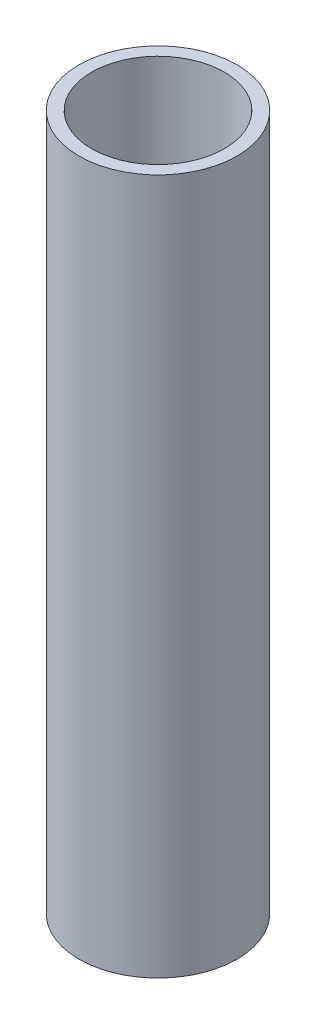
ISO-10303-21;
HEADER;
FILE_DESCRIPTION(('STEP AP214'),'2;1');
FILE_NAME('part.step','',(''),(''),'','','');
FILE_SCHEMA(('AUTOMOTIVE_DESIGN { 1 0 10303 214 1 1 1 1 }'));
ENDSEC;
DATA;
#1=APPLICATION_CONTEXT('core data for automotive mechanical design processes');
#2=APPLICATION_PROTOCOL_DEFINITION('international standard','automotive_design',2000,#1);
#3=PRODUCT_CONTEXT('',#1,'mechanical');
#4=PRODUCT('Part','Part','',(#3));
#5=PRODUCT_RELATED_PRODUCT_CATEGORY('part','',(#4));
#6=PRODUCT_DEFINITION_FORMATION('','',#4);
#7=PRODUCT_DEFINITION_CONTEXT('part definition',#1,'design');
#8=PRODUCT_DEFINITION('design','',#6,#7);
#9=PRODUCT_DEFINITION_SHAPE('','',#8);
#10=(LENGTH_UNIT() NAMED_UNIT(*) SI_UNIT(.MILLI.,.METRE.));
#11=(NAMED_UNIT(*) PLANE_ANGLE_UNIT() SI_UNIT($,.RADIAN.));
#12=(NAMED_UNIT(*) SI_UNIT($,.STERADIAN.) SOLID_ANGLE_UNIT());
#13=UNCERTAINTY_MEASURE_WITH_UNIT(LENGTH_MEASURE(1.E-05),#10,'distance_accuracy_value','');
#14=(GEOMETRIC_REPRESENTATION_CONTEXT(3) GLOBAL_UNCERTAINTY_ASSIGNED_CONTEXT((#13)) GLOBAL_UNIT_ASSIGNED_CONTEXT((#10,
#11,#12)) REPRESENTATION_CONTEXT('',''));
#15=CARTESIAN_POINT('',(0.,0.,0.));
#16=DIRECTION('',(0.,0.,1.));
#17=DIRECTION('',(1.,0.,0.));
#18=AXIS2_PLACEMENT_3D('',#15,#16,#17);
#19=CARTESIAN_POINT('',(0.,26.0212825230672,0.));
#20=DIRECTION('',(0.,1.,0.));
#21=DIRECTION('',(0.,0.,1.));
#22=AXIS2_PLACEMENT_3D('',#19,#20,#21);
#23=CYLINDRICAL_SURFACE('',#22,10.5);
#24=CARTESIAN_POINT('',(0.,86.,0.));
#25=DIRECTION('',(0.,1.,0.));
#26=DIRECTION('',(0.,0.,1.));
#27=AXIS2_PLACEMENT_3D('',#24,#25,#26);
#28=CIRCLE('',#27,10.5);
#29=CARTESIAN_POINT('',(0.,86.,10.5));
#30=VERTEX_POINT('',#29);
#31=EDGE_CURVE('E58',#30,#30,#28,.T.);
#32=ORIENTED_EDGE('',*,*,#31,.F.);
#33=EDGE_LOOP('',(#32));
#34=FACE_BOUND('',#33,.T.);
#35=CARTESIAN_POINT('',(0.,110.,0.));
#36=DIRECTION('',(0.,1.,0.));
#37=DIRECTION('',(0.,0.,1.));
#38=AXIS2_PLACEMENT_3D('',#35,#36,#37);
#39=CIRCLE('',#38,10.5);
#40=CARTESIAN_POINT('',(0.,110.,10.5));
#41=VERTEX_POINT('',#40);
#42=EDGE_CURVE('E10',#41,#41,#39,.T.);
#43=ORIENTED_EDGE('',*,*,#42,.T.);
#44=EDGE_LOOP('',(#43));
#45=FACE_BOUND('',#44,.T.);
#46=ADVANCED_FACE('F30',(#34,#45),#23,.F.);
#47=CARTESIAN_POINT('',(10.5,110.,0.));
#48=DIRECTION('',(0.,-1.,0.));
#49=DIRECTION('',(0.,0.,-1.));
#50=AXIS2_PLACEMENT_3D('',#47,#48,#49);
#51=PLANE('',#50);
#52=ORIENTED_EDGE('',*,*,#42,.F.);
#53=EDGE_LOOP('',(#52));
#54=FACE_BOUND('',#53,.T.);
#55=CARTESIAN_POINT('',(0.,110.,0.));
#56=DIRECTION('',(0.,1.,0.));
#57=DIRECTION('',(0.,0.,1.));
#58=AXIS2_PLACEMENT_3D('',#55,#56,#57);
#59=CIRCLE('',#58,12.5);
#60=CARTESIAN_POINT('',(0.,110.,12.5));
#61=VERTEX_POINT('',#60);
#62=EDGE_CURVE('E36',#61,#61,#59,.T.);
#63=ORIENTED_EDGE('',*,*,#62,.T.);
#64=EDGE_LOOP('',(#63));
#65=FACE_BOUND('',#64,.T.);
#66=ADVANCED_FACE('F65',(#54,#65),#51,.F.);
#67=CARTESIAN_POINT('',(0.,26.0212825230672,0.));
#68=DIRECTION('',(0.,1.,0.));
#69=DIRECTION('',(0.,0.,1.));
#70=AXIS2_PLACEMENT_3D('',#67,#68,#69);
#71=CYLINDRICAL_SURFACE('',#70,12.5);
#72=ORIENTED_EDGE('',*,*,#62,.F.);
#73=EDGE_LOOP('',(#72));
#74=FACE_BOUND('',#73,.T.);
#75=CARTESIAN_POINT('',(0.,0.,0.));
#76=DIRECTION('',(0.,1.,0.));
#77=DIRECTION('',(0.,0.,1.));
#78=AXIS2_PLACEMENT_3D('',#75,#76,#77);
#79=CIRCLE('',#78,12.5);
#80=CARTESIAN_POINT('',(0.,0.,12.5));
#81=VERTEX_POINT('',#80);
#82=EDGE_CURVE('E40',#81,#81,#79,.T.);
#83=ORIENTED_EDGE('',*,*,#82,.T.);
#84=EDGE_LOOP('',(#83));
#85=FACE_BOUND('',#84,.T.);
#86=ADVANCED_FACE('F69',(#74,#85),#71,.T.);
#87=CARTESIAN_POINT('',(12.5,0.,0.));
#88=DIRECTION('',(0.,1.,0.));
#89=DIRECTION('',(0.,0.,1.));
#90=AXIS2_PLACEMENT_3D('',#87,#88,#89);
#91=PLANE('',#90);
#92=ORIENTED_EDGE('',*,*,#82,.F.);
#93=EDGE_LOOP('',(#92));
#94=FACE_BOUND('',#93,.T.);
#95=CARTESIAN_POINT('',(0.,0.,0.));
#96=DIRECTION('',(0.,1.,0.));
#97=DIRECTION('',(0.,0.,1.));
#98=AXIS2_PLACEMENT_3D('',#95,#96,#97);
#99=CIRCLE('',#98,3.);
#100=CARTESIAN_POINT('',(0.,0.,3.));
#101=VERTEX_POINT('',#100);
#102=EDGE_CURVE('E44',#101,#101,#99,.T.);
#103=ORIENTED_EDGE('',*,*,#102,.T.);
#104=EDGE_LOOP('',(#103));
#105=FACE_BOUND('',#104,.T.);
#106=ADVANCED_FACE('F74',(#94,#105),#91,.F.);
#107=CARTESIAN_POINT('',(0.,26.0212825230672,0.));
#108=DIRECTION('',(0.,1.,0.));
#109=DIRECTION('',(0.,0.,1.));
#110=AXIS2_PLACEMENT_3D('',#107,#108,#109);
#111=CYLINDRICAL_SURFACE('',#110,3.);
#112=ORIENTED_EDGE('',*,*,#102,.F.);
#113=EDGE_LOOP('',(#112));
#114=FACE_BOUND('',#113,.T.);
#115=CARTESIAN_POINT('',(0.,3.,0.));
#116=DIRECTION('',(0.,1.,0.));
#117=DIRECTION('',(0.,0.,1.));
#118=AXIS2_PLACEMENT_3D('',#115,#116,#117);
#119=CIRCLE('',#118,3.);
#120=CARTESIAN_POINT('',(0.,3.,3.));
#121=VERTEX_POINT('',#120);
#122=EDGE_CURVE('E49',#121,#121,#119,.T.);
#123=ORIENTED_EDGE('',*,*,#122,.T.);
#124=EDGE_LOOP('',(#123));
#125=FACE_BOUND('',#124,.T.);
#126=ADVANCED_FACE('F80',(#114,#125),#111,.F.);
#127=CARTESIAN_POINT('',(3.,3.,0.));
#128=DIRECTION('',(0.,-1.,0.));
#129=DIRECTION('',(0.,0.,-1.));
#130=AXIS2_PLACEMENT_3D('',#127,#128,#129);
#131=PLANE('',#130);
#132=ORIENTED_EDGE('',*,*,#122,.F.);
#133=EDGE_LOOP('',(#132));
#134=FACE_BOUND('',#133,.T.);
#135=CARTESIAN_POINT('',(0.,3.,0.));
#136=DIRECTION('',(0.,1.,0.));
#137=DIRECTION('',(0.,0.,1.));
#138=AXIS2_PLACEMENT_3D('',#135,#136,#137);
#139=CIRCLE('',#138,8.50000000000001);
#140=CARTESIAN_POINT('',(0.,3.,8.50000000000001));
#141=VERTEX_POINT('',#140);
#142=EDGE_CURVE('E52',#141,#141,#139,.T.);
#143=ORIENTED_EDGE('',*,*,#142,.T.);
#144=EDGE_LOOP('',(#143));
#145=FACE_BOUND('',#144,.T.);
#146=ADVANCED_FACE('F84',(#134,#145),#131,.F.);
#147=CARTESIAN_POINT('',(0.,26.0212825230672,0.));
#148=DIRECTION('',(0.,1.,0.));
#149=DIRECTION('',(0.,0.,1.));
#150=AXIS2_PLACEMENT_3D('',#147,#148,#149);
#151=CYLINDRICAL_SURFACE('',#150,8.50000000000001);
#152=ORIENTED_EDGE('',*,*,#142,.F.);
#153=EDGE_LOOP('',(#152));
#154=FACE_BOUND('',#153,.T.);
#155=CARTESIAN_POINT('',(0.,86.,0.));
#156=DIRECTION('',(0.,1.,0.));
#157=DIRECTION('',(0.,0.,1.));
#158=AXIS2_PLACEMENT_3D('',#155,#156,#157);
#159=CIRCLE('',#158,8.5);
#160=CARTESIAN_POINT('',(0.,86.,8.5));
#161=VERTEX_POINT('',#160);
#162=EDGE_CURVE('E55',#161,#161,#159,.T.);
#163=ORIENTED_EDGE('',*,*,#162,.T.);
#164=EDGE_LOOP('',(#163));
#165=FACE_BOUND('',#164,.T.);
#166=ADVANCED_FACE('F88',(#154,#165),#151,.F.);
#167=CARTESIAN_POINT('',(8.5,86.,0.));
#168=DIRECTION('',(0.,-1.,0.));
#169=DIRECTION('',(0.,0.,-1.));
#170=AXIS2_PLACEMENT_3D('',#167,#168,#169);
#171=PLANE('',#170);
#172=ORIENTED_EDGE('',*,*,#162,.F.);
#173=EDGE_LOOP('',(#172));
#174=FACE_BOUND('',#173,.T.);
#175=ORIENTED_EDGE('',*,*,#31,.T.);
#176=EDGE_LOOP('',(#175));
#177=FACE_BOUND('',#176,.T.);
#178=ADVANCED_FACE('F62',(#174,#177),#171,.F.);
#179=CLOSED_SHELL('',(#46,#66,#86,#106,#126,#146,#166,#178));
#180=MANIFOLD_SOLID_BREP('B2',#179);
#181=ADVANCED_BREP_SHAPE_REPRESENTATION('',(#18,#180),#14);
#182=SHAPE_DEFINITION_REPRESENTATION(#9,#181);
ENDSEC;
END-ISO-10303-21;
